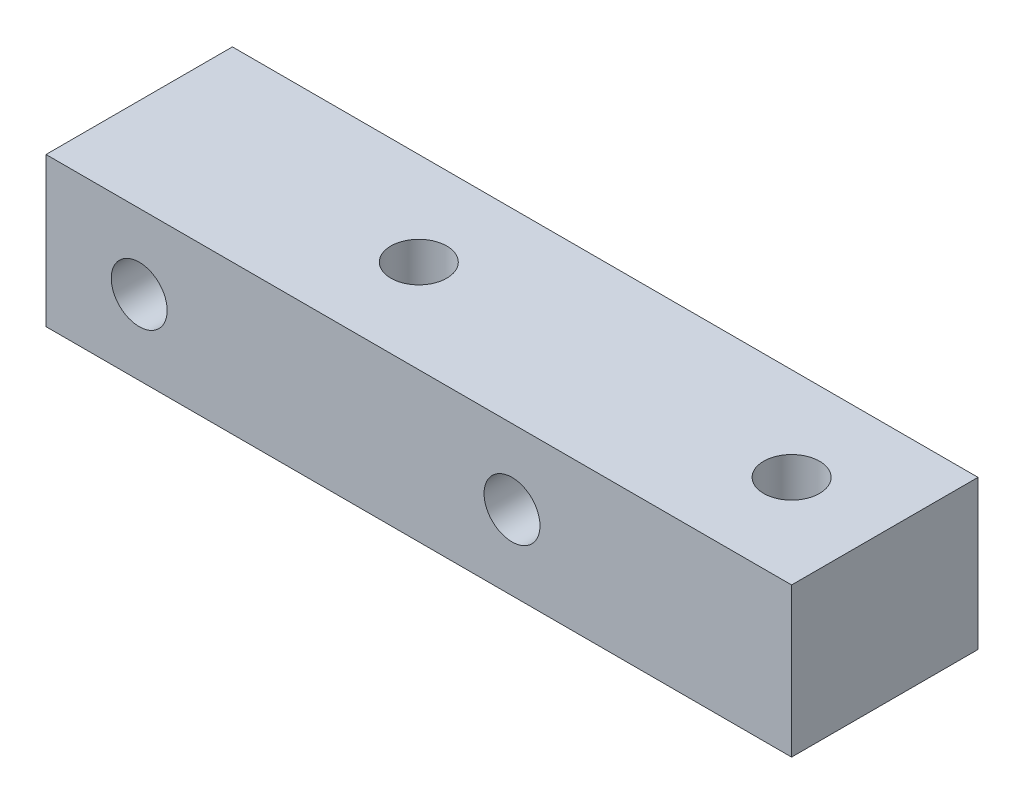
ISO-10303-21;
HEADER;
FILE_DESCRIPTION(('STEP AP214'),'2;1');
FILE_NAME('part.step','',(''),(''),'','','');
FILE_SCHEMA(('AUTOMOTIVE_DESIGN { 1 0 10303 214 1 1 1 1 }'));
ENDSEC;
DATA;
#1=APPLICATION_CONTEXT('core data for automotive mechanical design processes');
#2=APPLICATION_PROTOCOL_DEFINITION('international standard','automotive_design',2000,#1);
#3=PRODUCT_CONTEXT('',#1,'mechanical');
#4=PRODUCT('Part','Part','',(#3));
#5=PRODUCT_RELATED_PRODUCT_CATEGORY('part','',(#4));
#6=PRODUCT_DEFINITION_FORMATION('','',#4);
#7=PRODUCT_DEFINITION_CONTEXT('part definition',#1,'design');
#8=PRODUCT_DEFINITION('design','',#6,#7);
#9=PRODUCT_DEFINITION_SHAPE('','',#8);
#10=(LENGTH_UNIT() NAMED_UNIT(*) SI_UNIT(.MILLI.,.METRE.));
#11=(NAMED_UNIT(*) PLANE_ANGLE_UNIT() SI_UNIT($,.RADIAN.));
#12=(NAMED_UNIT(*) SI_UNIT($,.STERADIAN.) SOLID_ANGLE_UNIT());
#13=UNCERTAINTY_MEASURE_WITH_UNIT(LENGTH_MEASURE(1.E-05),#10,'distance_accuracy_value','');
#14=(GEOMETRIC_REPRESENTATION_CONTEXT(3) GLOBAL_UNCERTAINTY_ASSIGNED_CONTEXT((#13)) GLOBAL_UNIT_ASSIGNED_CONTEXT((#10,
#11,#12)) REPRESENTATION_CONTEXT('',''));
#15=CARTESIAN_POINT('',(0.,0.,0.));
#16=DIRECTION('',(0.,0.,1.));
#17=DIRECTION('',(1.,0.,0.));
#18=AXIS2_PLACEMENT_3D('',#15,#16,#17);
#19=CARTESIAN_POINT('',(0.,0.,10.));
#20=DIRECTION('',(0.,0.,1.));
#21=DIRECTION('',(1.,0.,0.));
#22=AXIS2_PLACEMENT_3D('',#19,#20,#21);
#23=PLANE('',#22);
#24=CARTESIAN_POINT('',(-15.,0.,10.));
#25=DIRECTION('',(0.,0.,1.));
#26=DIRECTION('',(1.,0.,0.));
#27=AXIS2_PLACEMENT_3D('',#24,#25,#26);
#28=CIRCLE('',#27,1.5);
#29=CARTESIAN_POINT('',(-13.5,0.,10.));
#30=VERTEX_POINT('',#29);
#31=EDGE_CURVE('E106',#30,#30,#28,.T.);
#32=ORIENTED_EDGE('',*,*,#31,.F.);
#33=EDGE_LOOP('',(#32));
#34=FACE_BOUND('',#33,.T.);
#35=DIRECTION('',(0.,1.,0.));
#36=VECTOR('',#35,1.);
#37=CARTESIAN_POINT('',(20.,4.00000000000001,10.));
#38=LINE('',#37,#36);
#39=CARTESIAN_POINT('',(20.,-4.00000000000001,10.));
#40=VERTEX_POINT('',#39);
#41=CARTESIAN_POINT('',(20.,4.00000000000001,10.));
#42=VERTEX_POINT('',#41);
#43=EDGE_CURVE('E91',#40,#42,#38,.T.);
#44=ORIENTED_EDGE('',*,*,#43,.T.);
#45=DIRECTION('',(-1.,0.,0.));
#46=VECTOR('',#45,1.);
#47=CARTESIAN_POINT('',(-20.,4.00000000000001,10.));
#48=LINE('',#47,#46);
#49=CARTESIAN_POINT('',(-20.,4.00000000000001,10.));
#50=VERTEX_POINT('',#49);
#51=EDGE_CURVE('E86',#42,#50,#48,.T.);
#52=ORIENTED_EDGE('',*,*,#51,.T.);
#53=DIRECTION('',(0.,-1.,0.));
#54=VECTOR('',#53,1.);
#55=CARTESIAN_POINT('',(-20.,4.00000000000001,10.));
#56=LINE('',#55,#54);
#57=CARTESIAN_POINT('',(-20.,-3.99999999999999,10.));
#58=VERTEX_POINT('',#57);
#59=EDGE_CURVE('E89',#50,#58,#56,.T.);
#60=ORIENTED_EDGE('',*,*,#59,.T.);
#61=DIRECTION('',(1.,0.,0.));
#62=VECTOR('',#61,1.);
#63=CARTESIAN_POINT('',(-20.,-3.99999999999999,10.));
#64=LINE('',#63,#62);
#65=EDGE_CURVE('E56',#58,#40,#64,.T.);
#66=ORIENTED_EDGE('',*,*,#65,.T.);
#67=EDGE_LOOP('',(#44,#52,#60,#66));
#68=FACE_BOUND('',#67,.T.);
#69=CARTESIAN_POINT('',(5.,0.,10.));
#70=DIRECTION('',(0.,0.,1.));
#71=DIRECTION('',(1.,0.,0.));
#72=AXIS2_PLACEMENT_3D('',#69,#70,#71);
#73=CIRCLE('',#72,1.5);
#74=CARTESIAN_POINT('',(6.5,0.,10.));
#75=VERTEX_POINT('',#74);
#76=EDGE_CURVE('E121',#75,#75,#73,.T.);
#77=ORIENTED_EDGE('',*,*,#76,.F.);
#78=EDGE_LOOP('',(#77));
#79=FACE_BOUND('',#78,.T.);
#80=ADVANCED_FACE('F39',(#34,#68,#79),#23,.T.);
#81=CARTESIAN_POINT('',(0.,0.,0.));
#82=DIRECTION('',(0.,0.,1.));
#83=DIRECTION('',(1.,0.,0.));
#84=AXIS2_PLACEMENT_3D('',#81,#82,#83);
#85=PLANE('',#84);
#86=DIRECTION('',(0.,1.,0.));
#87=VECTOR('',#86,1.);
#88=CARTESIAN_POINT('',(20.,4.00000000000001,0.));
#89=LINE('',#88,#87);
#90=CARTESIAN_POINT('',(20.,-4.00000000000001,0.));
#91=VERTEX_POINT('',#90);
#92=CARTESIAN_POINT('',(20.,4.00000000000001,0.));
#93=VERTEX_POINT('',#92);
#94=EDGE_CURVE('E103',#91,#93,#89,.T.);
#95=ORIENTED_EDGE('',*,*,#94,.F.);
#96=DIRECTION('',(1.,0.,0.));
#97=VECTOR('',#96,1.);
#98=CARTESIAN_POINT('',(-20.,-3.99999999999999,0.));
#99=LINE('',#98,#97);
#100=CARTESIAN_POINT('',(-20.,-3.99999999999999,0.));
#101=VERTEX_POINT('',#100);
#102=EDGE_CURVE('E79',#101,#91,#99,.T.);
#103=ORIENTED_EDGE('',*,*,#102,.F.);
#104=DIRECTION('',(0.,-1.,0.));
#105=VECTOR('',#104,1.);
#106=CARTESIAN_POINT('',(-20.,4.00000000000001,0.));
#107=LINE('',#106,#105);
#108=CARTESIAN_POINT('',(-20.,4.00000000000001,0.));
#109=VERTEX_POINT('',#108);
#110=EDGE_CURVE('E73',#109,#101,#107,.T.);
#111=ORIENTED_EDGE('',*,*,#110,.F.);
#112=DIRECTION('',(-1.,0.,0.));
#113=VECTOR('',#112,1.);
#114=CARTESIAN_POINT('',(-20.,4.00000000000001,0.));
#115=LINE('',#114,#113);
#116=EDGE_CURVE('E95',#93,#109,#115,.T.);
#117=ORIENTED_EDGE('',*,*,#116,.F.);
#118=EDGE_LOOP('',(#95,#103,#111,#117));
#119=FACE_BOUND('',#118,.T.);
#120=CARTESIAN_POINT('',(-15.,0.,0.));
#121=DIRECTION('',(0.,0.,1.));
#122=DIRECTION('',(1.,0.,0.));
#123=AXIS2_PLACEMENT_3D('',#120,#121,#122);
#124=CIRCLE('',#123,1.5);
#125=CARTESIAN_POINT('',(-13.5,0.,0.));
#126=VERTEX_POINT('',#125);
#127=EDGE_CURVE('E118',#126,#126,#124,.T.);
#128=ORIENTED_EDGE('',*,*,#127,.T.);
#129=EDGE_LOOP('',(#128));
#130=FACE_BOUND('',#129,.T.);
#131=CARTESIAN_POINT('',(5.,0.,0.));
#132=DIRECTION('',(0.,0.,1.));
#133=DIRECTION('',(1.,0.,0.));
#134=AXIS2_PLACEMENT_3D('',#131,#132,#133);
#135=CIRCLE('',#134,1.5);
#136=CARTESIAN_POINT('',(6.5,0.,0.));
#137=VERTEX_POINT('',#136);
#138=EDGE_CURVE('E124',#137,#137,#135,.T.);
#139=ORIENTED_EDGE('',*,*,#138,.T.);
#140=EDGE_LOOP('',(#139));
#141=FACE_BOUND('',#140,.T.);
#142=ADVANCED_FACE('F114',(#119,#130,#141),#85,.F.);
#143=CARTESIAN_POINT('',(20.,4.00000000000001,10.));
#144=DIRECTION('',(-1.,0.,0.));
#145=DIRECTION('',(0.,0.,1.));
#146=AXIS2_PLACEMENT_3D('',#143,#144,#145);
#147=PLANE('',#146);
#148=ORIENTED_EDGE('',*,*,#94,.T.);
#149=DIRECTION('',(0.,0.,-1.));
#150=VECTOR('',#149,1.);
#151=CARTESIAN_POINT('',(20.,4.00000000000001,10.));
#152=LINE('',#151,#150);
#153=EDGE_CURVE('E11',#42,#93,#152,.T.);
#154=ORIENTED_EDGE('',*,*,#153,.F.);
#155=ORIENTED_EDGE('',*,*,#43,.F.);
#156=DIRECTION('',(0.,0.,-1.));
#157=VECTOR('',#156,1.);
#158=CARTESIAN_POINT('',(20.,-4.00000000000001,10.));
#159=LINE('',#158,#157);
#160=EDGE_CURVE('E99',#40,#91,#159,.T.);
#161=ORIENTED_EDGE('',*,*,#160,.T.);
#162=EDGE_LOOP('',(#148,#154,#155,#161));
#163=FACE_BOUND('',#162,.T.);
#164=ADVANCED_FACE('F41',(#163),#147,.F.);
#165=CARTESIAN_POINT('',(-20.,4.00000000000001,10.));
#166=DIRECTION('',(0.,-1.,0.));
#167=DIRECTION('',(1.,0.,0.));
#168=AXIS2_PLACEMENT_3D('',#165,#166,#167);
#169=PLANE('',#168);
#170=CARTESIAN_POINT('',(-5.,4.00000000000001,5.00000000000001));
#171=DIRECTION('',(0.,1.,0.));
#172=DIRECTION('',(0.,0.,1.));
#173=AXIS2_PLACEMENT_3D('',#170,#171,#172);
#174=CIRCLE('',#173,1.5);
#175=CARTESIAN_POINT('',(-5.,4.00000000000001,6.50000000000001));
#176=VERTEX_POINT('',#175);
#177=EDGE_CURVE('E136',#176,#176,#174,.T.);
#178=ORIENTED_EDGE('',*,*,#177,.F.);
#179=EDGE_LOOP('',(#178));
#180=FACE_BOUND('',#179,.T.);
#181=CARTESIAN_POINT('',(15.,4.00000000000001,5.));
#182=DIRECTION('',(0.,1.,0.));
#183=DIRECTION('',(0.,0.,1.));
#184=AXIS2_PLACEMENT_3D('',#181,#182,#183);
#185=CIRCLE('',#184,1.5);
#186=CARTESIAN_POINT('',(15.,4.00000000000001,6.5));
#187=VERTEX_POINT('',#186);
#188=EDGE_CURVE('E133',#187,#187,#185,.T.);
#189=ORIENTED_EDGE('',*,*,#188,.F.);
#190=EDGE_LOOP('',(#189));
#191=FACE_BOUND('',#190,.T.);
#192=ORIENTED_EDGE('',*,*,#116,.T.);
#193=DIRECTION('',(0.,0.,-1.));
#194=VECTOR('',#193,1.);
#195=CARTESIAN_POINT('',(-20.,4.00000000000001,10.));
#196=LINE('',#195,#194);
#197=EDGE_CURVE('E48',#50,#109,#196,.T.);
#198=ORIENTED_EDGE('',*,*,#197,.F.);
#199=ORIENTED_EDGE('',*,*,#51,.F.);
#200=ORIENTED_EDGE('',*,*,#153,.T.);
#201=EDGE_LOOP('',(#192,#198,#199,#200));
#202=FACE_BOUND('',#201,.T.);
#203=ADVANCED_FACE('F94',(#180,#191,#202),#169,.F.);
#204=CARTESIAN_POINT('',(-20.,4.00000000000001,10.));
#205=DIRECTION('',(1.,0.,0.));
#206=DIRECTION('',(0.,1.,0.));
#207=AXIS2_PLACEMENT_3D('',#204,#205,#206);
#208=PLANE('',#207);
#209=ORIENTED_EDGE('',*,*,#110,.T.);
#210=DIRECTION('',(0.,0.,-1.));
#211=VECTOR('',#210,1.);
#212=CARTESIAN_POINT('',(-20.,-3.99999999999999,10.));
#213=LINE('',#212,#211);
#214=EDGE_CURVE('E96',#58,#101,#213,.T.);
#215=ORIENTED_EDGE('',*,*,#214,.F.);
#216=ORIENTED_EDGE('',*,*,#59,.F.);
#217=ORIENTED_EDGE('',*,*,#197,.T.);
#218=EDGE_LOOP('',(#209,#215,#216,#217));
#219=FACE_BOUND('',#218,.T.);
#220=ADVANCED_FACE('F97',(#219),#208,.F.);
#221=CARTESIAN_POINT('',(-20.,-3.99999999999999,10.));
#222=DIRECTION('',(0.,1.,0.));
#223=DIRECTION('',(-1.,0.,0.));
#224=AXIS2_PLACEMENT_3D('',#221,#222,#223);
#225=PLANE('',#224);
#226=CARTESIAN_POINT('',(-5.,-4.00000000000001,5.00000000000001));
#227=DIRECTION('',(0.,1.,0.));
#228=DIRECTION('',(0.,0.,1.));
#229=AXIS2_PLACEMENT_3D('',#226,#227,#228);
#230=CIRCLE('',#229,1.5);
#231=CARTESIAN_POINT('',(-5.,-4.00000000000001,6.50000000000001));
#232=VERTEX_POINT('',#231);
#233=EDGE_CURVE('E127',#232,#232,#230,.T.);
#234=ORIENTED_EDGE('',*,*,#233,.T.);
#235=EDGE_LOOP('',(#234));
#236=FACE_BOUND('',#235,.T.);
#237=CARTESIAN_POINT('',(15.,-4.00000000000001,5.));
#238=DIRECTION('',(0.,1.,0.));
#239=DIRECTION('',(0.,0.,1.));
#240=AXIS2_PLACEMENT_3D('',#237,#238,#239);
#241=CIRCLE('',#240,1.5);
#242=CARTESIAN_POINT('',(15.,-4.00000000000001,6.5));
#243=VERTEX_POINT('',#242);
#244=EDGE_CURVE('E130',#243,#243,#241,.T.);
#245=ORIENTED_EDGE('',*,*,#244,.T.);
#246=EDGE_LOOP('',(#245));
#247=FACE_BOUND('',#246,.T.);
#248=ORIENTED_EDGE('',*,*,#102,.T.);
#249=ORIENTED_EDGE('',*,*,#160,.F.);
#250=ORIENTED_EDGE('',*,*,#65,.F.);
#251=ORIENTED_EDGE('',*,*,#214,.T.);
#252=EDGE_LOOP('',(#248,#249,#250,#251));
#253=FACE_BOUND('',#252,.T.);
#254=ADVANCED_FACE('F111',(#236,#247,#253),#225,.F.);
#255=CARTESIAN_POINT('',(-15.,0.,10.));
#256=DIRECTION('',(0.,0.,-1.));
#257=DIRECTION('',(-1.,0.,0.));
#258=AXIS2_PLACEMENT_3D('',#255,#256,#257);
#259=CYLINDRICAL_SURFACE('',#258,1.5);
#260=ORIENTED_EDGE('',*,*,#31,.T.);
#261=EDGE_LOOP('',(#260));
#262=FACE_BOUND('',#261,.T.);
#263=ORIENTED_EDGE('',*,*,#127,.F.);
#264=EDGE_LOOP('',(#263));
#265=FACE_BOUND('',#264,.T.);
#266=ADVANCED_FACE('F162',(#262,#265),#259,.F.);
#267=CARTESIAN_POINT('',(5.,0.,10.));
#268=DIRECTION('',(0.,0.,-1.));
#269=DIRECTION('',(-1.,0.,0.));
#270=AXIS2_PLACEMENT_3D('',#267,#268,#269);
#271=CYLINDRICAL_SURFACE('',#270,1.5);
#272=ORIENTED_EDGE('',*,*,#76,.T.);
#273=EDGE_LOOP('',(#272));
#274=FACE_BOUND('',#273,.T.);
#275=ORIENTED_EDGE('',*,*,#138,.F.);
#276=EDGE_LOOP('',(#275));
#277=FACE_BOUND('',#276,.T.);
#278=ADVANCED_FACE('F156',(#274,#277),#271,.F.);
#279=CARTESIAN_POINT('',(15.,-4.00000000000001,5.));
#280=DIRECTION('',(0.,1.,0.));
#281=DIRECTION('',(0.,0.,1.));
#282=AXIS2_PLACEMENT_3D('',#279,#280,#281);
#283=CYLINDRICAL_SURFACE('',#282,1.5);
#284=ORIENTED_EDGE('',*,*,#244,.F.);
#285=EDGE_LOOP('',(#284));
#286=FACE_BOUND('',#285,.T.);
#287=ORIENTED_EDGE('',*,*,#188,.T.);
#288=EDGE_LOOP('',(#287));
#289=FACE_BOUND('',#288,.T.);
#290=ADVANCED_FACE('F147',(#286,#289),#283,.F.);
#291=CARTESIAN_POINT('',(-5.,-4.00000000000001,5.00000000000001));
#292=DIRECTION('',(0.,1.,0.));
#293=DIRECTION('',(0.,0.,1.));
#294=AXIS2_PLACEMENT_3D('',#291,#292,#293);
#295=CYLINDRICAL_SURFACE('',#294,1.5);
#296=ORIENTED_EDGE('',*,*,#233,.F.);
#297=EDGE_LOOP('',(#296));
#298=FACE_BOUND('',#297,.T.);
#299=ORIENTED_EDGE('',*,*,#177,.T.);
#300=EDGE_LOOP('',(#299));
#301=FACE_BOUND('',#300,.T.);
#302=ADVANCED_FACE('F144',(#298,#301),#295,.F.);
#303=CLOSED_SHELL('',(#80,#142,#164,#203,#220,#254,#266,#278,#290,#302));
#304=MANIFOLD_SOLID_BREP('B2',#303);
#305=ADVANCED_BREP_SHAPE_REPRESENTATION('',(#18,#304),#14);
#306=SHAPE_DEFINITION_REPRESENTATION(#9,#305);
ENDSEC;
END-ISO-10303-21;
